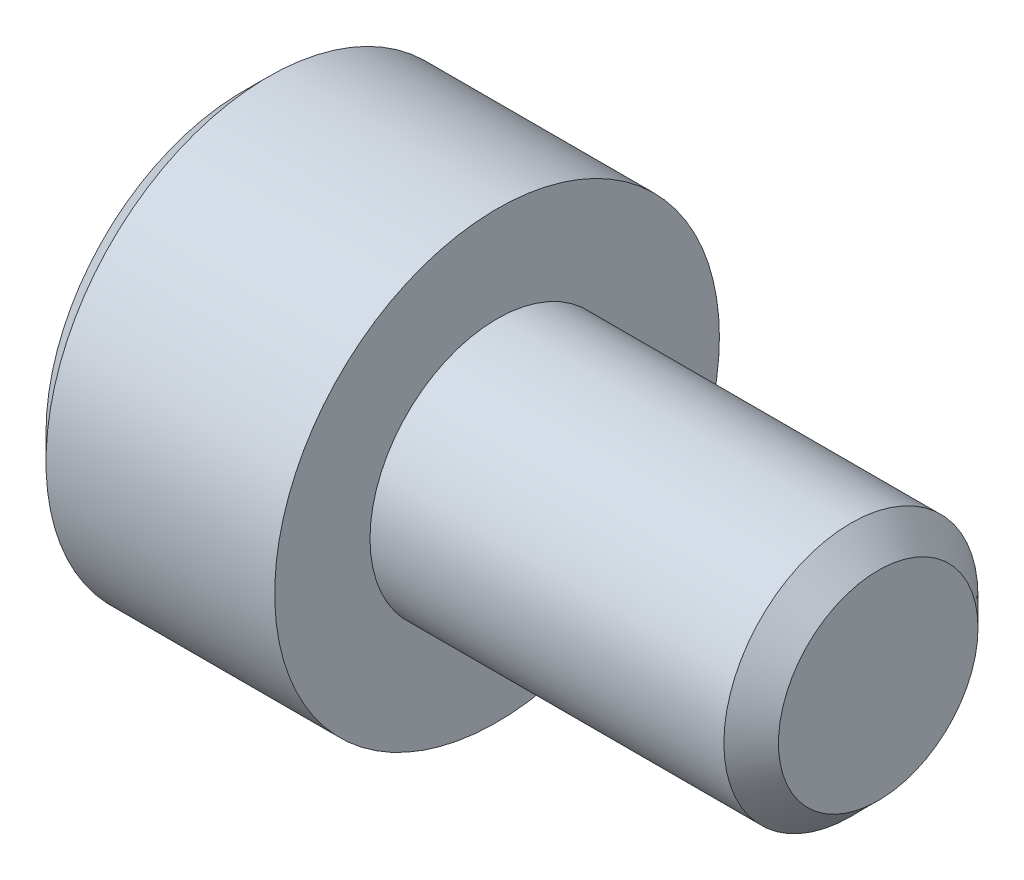
ISO-10303-21;
HEADER;
FILE_DESCRIPTION(('STEP AP214'),'2;1');
FILE_NAME('part.step','',(''),(''),'','','');
FILE_SCHEMA(('AUTOMOTIVE_DESIGN { 1 0 10303 214 1 1 1 1 }'));
ENDSEC;
DATA;
#1=APPLICATION_CONTEXT('core data for automotive mechanical design processes');
#2=APPLICATION_PROTOCOL_DEFINITION('international standard','automotive_design',2000,#1);
#3=PRODUCT_CONTEXT('',#1,'mechanical');
#4=PRODUCT('Part','Part','',(#3));
#5=PRODUCT_RELATED_PRODUCT_CATEGORY('part','',(#4));
#6=PRODUCT_DEFINITION_FORMATION('','',#4);
#7=PRODUCT_DEFINITION_CONTEXT('part definition',#1,'design');
#8=PRODUCT_DEFINITION('design','',#6,#7);
#9=PRODUCT_DEFINITION_SHAPE('','',#8);
#10=(LENGTH_UNIT() NAMED_UNIT(*) SI_UNIT(.MILLI.,.METRE.));
#11=(NAMED_UNIT(*) PLANE_ANGLE_UNIT() SI_UNIT($,.RADIAN.));
#12=(NAMED_UNIT(*) SI_UNIT($,.STERADIAN.) SOLID_ANGLE_UNIT());
#13=UNCERTAINTY_MEASURE_WITH_UNIT(LENGTH_MEASURE(1.E-05),#10,'distance_accuracy_value','');
#14=(GEOMETRIC_REPRESENTATION_CONTEXT(3) GLOBAL_UNCERTAINTY_ASSIGNED_CONTEXT((#13)) GLOBAL_UNIT_ASSIGNED_CONTEXT((#10,
#11,#12)) REPRESENTATION_CONTEXT('',''));
#15=CARTESIAN_POINT('',(0.,0.,0.));
#16=DIRECTION('',(0.,0.,1.));
#17=DIRECTION('',(1.,0.,0.));
#18=AXIS2_PLACEMENT_3D('',#15,#16,#17);
#19=CARTESIAN_POINT('',(-2.,0.,0.));
#20=DIRECTION('',(-1.,0.,0.));
#21=DIRECTION('',(0.,0.,1.));
#22=AXIS2_PLACEMENT_3D('',#19,#20,#21);
#23=CONICAL_SURFACE('',#22,1.5,1.30899693899575);
#24=CARTESIAN_POINT('',(-2.,0.,0.));
#25=DIRECTION('',(1.,0.,0.));
#26=DIRECTION('',(0.,0.,-1.));
#27=AXIS2_PLACEMENT_3D('',#24,#25,#26);
#28=CIRCLE('',#27,1.5);
#29=CARTESIAN_POINT('',(-2.,1.29903810567666,-0.75));
#30=VERTEX_POINT('',#29);
#31=CARTESIAN_POINT('',(-2.,1.29903810567666,0.75));
#32=VERTEX_POINT('',#31);
#33=EDGE_CURVE('E231',#30,#32,#28,.T.);
#34=ORIENTED_EDGE('',*,*,#33,.F.);
#35=CARTESIAN_POINT('',(-2.,0.,0.));
#36=DIRECTION('',(1.,0.,0.));
#37=DIRECTION('',(0.,0.,-1.));
#38=AXIS2_PLACEMENT_3D('',#35,#36,#37);
#39=CIRCLE('',#38,1.5);
#40=CARTESIAN_POINT('',(-2.,0.,-1.5));
#41=VERTEX_POINT('',#40);
#42=EDGE_CURVE('E228',#41,#30,#39,.T.);
#43=ORIENTED_EDGE('',*,*,#42,.F.);
#44=CARTESIAN_POINT('',(-2.,0.,0.));
#45=DIRECTION('',(1.,0.,0.));
#46=DIRECTION('',(0.,0.,-1.));
#47=AXIS2_PLACEMENT_3D('',#44,#45,#46);
#48=CIRCLE('',#47,1.5);
#49=CARTESIAN_POINT('',(-2.,-1.29903810567666,-0.75));
#50=VERTEX_POINT('',#49);
#51=EDGE_CURVE('E11',#50,#41,#48,.T.);
#52=ORIENTED_EDGE('',*,*,#51,.F.);
#53=CARTESIAN_POINT('',(-2.,0.,0.));
#54=DIRECTION('',(1.,0.,0.));
#55=DIRECTION('',(0.,0.,-1.));
#56=AXIS2_PLACEMENT_3D('',#53,#54,#55);
#57=CIRCLE('',#56,1.5);
#58=CARTESIAN_POINT('',(-2.,-1.29903810567666,0.75));
#59=VERTEX_POINT('',#58);
#60=EDGE_CURVE('E27',#59,#50,#57,.T.);
#61=ORIENTED_EDGE('',*,*,#60,.F.);
#62=CARTESIAN_POINT('',(-2.,0.,0.));
#63=DIRECTION('',(1.,0.,0.));
#64=DIRECTION('',(0.,0.,-1.));
#65=AXIS2_PLACEMENT_3D('',#62,#63,#64);
#66=CIRCLE('',#65,1.5);
#67=CARTESIAN_POINT('',(-2.,0.,1.5));
#68=VERTEX_POINT('',#67);
#69=EDGE_CURVE('E179',#68,#59,#66,.T.);
#70=ORIENTED_EDGE('',*,*,#69,.F.);
#71=CARTESIAN_POINT('',(-2.,0.,0.));
#72=DIRECTION('',(1.,0.,0.));
#73=DIRECTION('',(0.,0.,-1.));
#74=AXIS2_PLACEMENT_3D('',#71,#72,#73);
#75=CIRCLE('',#74,1.5);
#76=EDGE_CURVE('E39',#32,#68,#75,.T.);
#77=ORIENTED_EDGE('',*,*,#76,.F.);
#78=EDGE_LOOP('',(#34,#43,#52,#61,#70,#77));
#79=FACE_BOUND('',#78,.T.);
#80=CARTESIAN_POINT('',(-1.59807621135332,0.,0.));
#81=VERTEX_POINT('',#80);
#82=VERTEX_LOOP('',#81);
#83=FACE_BOUND('',#82,.T.);
#84=ADVANCED_FACE('F17',(#79,#83),#23,.F.);
#85=CARTESIAN_POINT('',(-2.,0.,0.));
#86=DIRECTION('',(1.,0.,0.));
#87=DIRECTION('',(0.,1.,0.));
#88=AXIS2_PLACEMENT_3D('',#85,#86,#87);
#89=PLANE('',#88);
#90=ORIENTED_EDGE('',*,*,#51,.T.);
#91=DIRECTION('',(0.,1.,0.));
#92=VECTOR('',#91,1.);
#93=CARTESIAN_POINT('',(-2.,-0.866025403784439,-1.5));
#94=LINE('',#93,#92);
#95=CARTESIAN_POINT('',(-2.,-0.866025403784439,-1.5));
#96=VERTEX_POINT('',#95);
#97=EDGE_CURVE('E185',#96,#41,#94,.T.);
#98=ORIENTED_EDGE('',*,*,#97,.F.);
#99=DIRECTION('',(0.,0.5,-0.866025403784439));
#100=VECTOR('',#99,1.);
#101=CARTESIAN_POINT('',(-2.,-1.73205080756888,0.));
#102=LINE('',#101,#100);
#103=EDGE_CURVE('E182',#50,#96,#102,.T.);
#104=ORIENTED_EDGE('',*,*,#103,.F.);
#105=EDGE_LOOP('',(#90,#98,#104));
#106=FACE_BOUND('',#105,.T.);
#107=ADVANCED_FACE('F19',(#106),#89,.F.);
#108=CARTESIAN_POINT('',(-2.,0.,0.));
#109=DIRECTION('',(1.,0.,0.));
#110=DIRECTION('',(0.,1.,0.));
#111=AXIS2_PLACEMENT_3D('',#108,#109,#110);
#112=PLANE('',#111);
#113=ORIENTED_EDGE('',*,*,#60,.T.);
#114=DIRECTION('',(0.,0.5,-0.866025403784439));
#115=VECTOR('',#114,1.);
#116=CARTESIAN_POINT('',(-2.,-1.73205080756888,0.));
#117=LINE('',#116,#115);
#118=CARTESIAN_POINT('',(-2.,-1.73205080756888,0.));
#119=VERTEX_POINT('',#118);
#120=EDGE_CURVE('E172',#119,#50,#117,.T.);
#121=ORIENTED_EDGE('',*,*,#120,.F.);
#122=DIRECTION('',(0.,-0.5,-0.866025403784439));
#123=VECTOR('',#122,1.);
#124=CARTESIAN_POINT('',(-2.,-0.866025403784439,1.5));
#125=LINE('',#124,#123);
#126=EDGE_CURVE('E175',#59,#119,#125,.T.);
#127=ORIENTED_EDGE('',*,*,#126,.F.);
#128=EDGE_LOOP('',(#113,#121,#127));
#129=FACE_BOUND('',#128,.T.);
#130=ADVANCED_FACE('F143',(#129),#112,.F.);
#131=CARTESIAN_POINT('',(-2.,0.,0.));
#132=DIRECTION('',(1.,0.,0.));
#133=DIRECTION('',(0.,1.,0.));
#134=AXIS2_PLACEMENT_3D('',#131,#132,#133);
#135=PLANE('',#134);
#136=ORIENTED_EDGE('',*,*,#69,.T.);
#137=DIRECTION('',(0.,-0.5,-0.866025403784439));
#138=VECTOR('',#137,1.);
#139=CARTESIAN_POINT('',(-2.,-0.866025403784439,1.5));
#140=LINE('',#139,#138);
#141=CARTESIAN_POINT('',(-2.,-0.866025403784439,1.5));
#142=VERTEX_POINT('',#141);
#143=EDGE_CURVE('E303',#142,#59,#140,.T.);
#144=ORIENTED_EDGE('',*,*,#143,.F.);
#145=DIRECTION('',(0.,-1.,0.));
#146=VECTOR('',#145,1.);
#147=CARTESIAN_POINT('',(-2.,0.866025403784439,1.5));
#148=LINE('',#147,#146);
#149=EDGE_CURVE('E289',#68,#142,#148,.T.);
#150=ORIENTED_EDGE('',*,*,#149,.F.);
#151=EDGE_LOOP('',(#136,#144,#150));
#152=FACE_BOUND('',#151,.T.);
#153=ADVANCED_FACE('F160',(#152),#135,.F.);
#154=CARTESIAN_POINT('',(-2.,0.,0.));
#155=DIRECTION('',(1.,0.,0.));
#156=DIRECTION('',(0.,1.,0.));
#157=AXIS2_PLACEMENT_3D('',#154,#155,#156);
#158=PLANE('',#157);
#159=ORIENTED_EDGE('',*,*,#76,.T.);
#160=DIRECTION('',(0.,-1.,0.));
#161=VECTOR('',#160,1.);
#162=CARTESIAN_POINT('',(-2.,0.866025403784439,1.5));
#163=LINE('',#162,#161);
#164=CARTESIAN_POINT('',(-2.,0.866025403784439,1.5));
#165=VERTEX_POINT('',#164);
#166=EDGE_CURVE('E284',#165,#68,#163,.T.);
#167=ORIENTED_EDGE('',*,*,#166,.F.);
#168=DIRECTION('',(0.,-0.5,0.866025403784439));
#169=VECTOR('',#168,1.);
#170=CARTESIAN_POINT('',(-2.,1.73205080756888,0.));
#171=LINE('',#170,#169);
#172=EDGE_CURVE('E225',#32,#165,#171,.T.);
#173=ORIENTED_EDGE('',*,*,#172,.F.);
#174=EDGE_LOOP('',(#159,#167,#173));
#175=FACE_BOUND('',#174,.T.);
#176=ADVANCED_FACE('F156',(#175),#158,.F.);
#177=CARTESIAN_POINT('',(-2.,0.,0.));
#178=DIRECTION('',(1.,0.,0.));
#179=DIRECTION('',(0.,1.,0.));
#180=AXIS2_PLACEMENT_3D('',#177,#178,#179);
#181=PLANE('',#180);
#182=DIRECTION('',(0.,0.5,0.866025403784439));
#183=VECTOR('',#182,1.);
#184=CARTESIAN_POINT('',(-2.,0.866025403784439,-1.5));
#185=LINE('',#184,#183);
#186=CARTESIAN_POINT('',(-2.,1.73205080756888,0.));
#187=VERTEX_POINT('',#186);
#188=EDGE_CURVE('E214',#30,#187,#185,.T.);
#189=ORIENTED_EDGE('',*,*,#188,.F.);
#190=ORIENTED_EDGE('',*,*,#33,.T.);
#191=DIRECTION('',(0.,-0.5,0.866025403784439));
#192=VECTOR('',#191,1.);
#193=CARTESIAN_POINT('',(-2.,1.73205080756888,0.));
#194=LINE('',#193,#192);
#195=EDGE_CURVE('E221',#187,#32,#194,.T.);
#196=ORIENTED_EDGE('',*,*,#195,.F.);
#197=EDGE_LOOP('',(#189,#190,#196));
#198=FACE_BOUND('',#197,.T.);
#199=ADVANCED_FACE('F152',(#198),#181,.F.);
#200=CARTESIAN_POINT('',(-2.,0.,0.));
#201=DIRECTION('',(1.,0.,0.));
#202=DIRECTION('',(0.,1.,0.));
#203=AXIS2_PLACEMENT_3D('',#200,#201,#202);
#204=PLANE('',#203);
#205=ORIENTED_EDGE('',*,*,#42,.T.);
#206=DIRECTION('',(0.,0.5,0.866025403784439));
#207=VECTOR('',#206,1.);
#208=CARTESIAN_POINT('',(-2.,0.866025403784439,-1.5));
#209=LINE('',#208,#207);
#210=CARTESIAN_POINT('',(-2.,0.866025403784438,-1.5));
#211=VERTEX_POINT('',#210);
#212=EDGE_CURVE('E213',#211,#30,#209,.T.);
#213=ORIENTED_EDGE('',*,*,#212,.F.);
#214=DIRECTION('',(0.,1.,0.));
#215=VECTOR('',#214,1.);
#216=CARTESIAN_POINT('',(-2.,-0.866025403784439,-1.5));
#217=LINE('',#216,#215);
#218=EDGE_CURVE('E206',#41,#211,#217,.T.);
#219=ORIENTED_EDGE('',*,*,#218,.F.);
#220=EDGE_LOOP('',(#205,#213,#219));
#221=FACE_BOUND('',#220,.T.);
#222=ADVANCED_FACE('F149',(#221),#204,.F.);
#223=CARTESIAN_POINT('',(-2.,1.73205080756888,0.));
#224=DIRECTION('',(0.,-0.866025403784439,-0.5));
#225=DIRECTION('',(0.,0.5,-0.866025403784439));
#226=AXIS2_PLACEMENT_3D('',#223,#224,#225);
#227=PLANE('',#226);
#228=DIRECTION('',(0.,-0.5,0.866025403784439));
#229=VECTOR('',#228,1.);
#230=CARTESIAN_POINT('',(-4.,1.73205080756888,0.));
#231=LINE('',#230,#229);
#232=CARTESIAN_POINT('',(-4.,1.73205080756888,0.));
#233=VERTEX_POINT('',#232);
#234=CARTESIAN_POINT('',(-4.,0.866025403784439,1.5));
#235=VERTEX_POINT('',#234);
#236=EDGE_CURVE('E256',#233,#235,#231,.T.);
#237=ORIENTED_EDGE('',*,*,#236,.F.);
#238=DIRECTION('',(-1.,0.,0.));
#239=VECTOR('',#238,1.);
#240=CARTESIAN_POINT('',(-2.,1.73205080756888,0.));
#241=LINE('',#240,#239);
#242=EDGE_CURVE('E218',#187,#233,#241,.T.);
#243=ORIENTED_EDGE('',*,*,#242,.F.);
#244=ORIENTED_EDGE('',*,*,#195,.T.);
#245=ORIENTED_EDGE('',*,*,#172,.T.);
#246=DIRECTION('',(-1.,0.,0.));
#247=VECTOR('',#246,1.);
#248=CARTESIAN_POINT('',(-2.,0.866025403784439,1.5));
#249=LINE('',#248,#247);
#250=EDGE_CURVE('E281',#165,#235,#249,.T.);
#251=ORIENTED_EDGE('',*,*,#250,.T.);
#252=EDGE_LOOP('',(#237,#243,#244,#245,#251));
#253=FACE_BOUND('',#252,.T.);
#254=ADVANCED_FACE('F147',(#253),#227,.T.);
#255=CARTESIAN_POINT('',(-2.,0.866025403784439,-1.5));
#256=DIRECTION('',(0.,-0.866025403784439,0.5));
#257=DIRECTION('',(-1.,0.,0.));
#258=AXIS2_PLACEMENT_3D('',#255,#256,#257);
#259=PLANE('',#258);
#260=DIRECTION('',(0.,0.5,0.866025403784439));
#261=VECTOR('',#260,1.);
#262=CARTESIAN_POINT('',(-4.,0.866025403784439,-1.5));
#263=LINE('',#262,#261);
#264=CARTESIAN_POINT('',(-4.,0.866025403784438,-1.5));
#265=VERTEX_POINT('',#264);
#266=EDGE_CURVE('E264',#265,#233,#263,.T.);
#267=ORIENTED_EDGE('',*,*,#266,.F.);
#268=DIRECTION('',(-1.,0.,0.));
#269=VECTOR('',#268,1.);
#270=CARTESIAN_POINT('',(-2.,0.866025403784438,-1.5));
#271=LINE('',#270,#269);
#272=EDGE_CURVE('E210',#211,#265,#271,.T.);
#273=ORIENTED_EDGE('',*,*,#272,.F.);
#274=ORIENTED_EDGE('',*,*,#212,.T.);
#275=ORIENTED_EDGE('',*,*,#188,.T.);
#276=ORIENTED_EDGE('',*,*,#242,.T.);
#277=EDGE_LOOP('',(#267,#273,#274,#275,#276));
#278=FACE_BOUND('',#277,.T.);
#279=ADVANCED_FACE('F323',(#278),#259,.T.);
#280=CARTESIAN_POINT('',(-2.,-0.866025403784439,-1.5));
#281=DIRECTION('',(0.,0.,1.));
#282=DIRECTION('',(1.,0.,0.));
#283=AXIS2_PLACEMENT_3D('',#280,#281,#282);
#284=PLANE('',#283);
#285=DIRECTION('',(0.,1.,0.));
#286=VECTOR('',#285,1.);
#287=CARTESIAN_POINT('',(-4.,-0.866025403784439,-1.5));
#288=LINE('',#287,#286);
#289=CARTESIAN_POINT('',(-4.,-0.866025403784439,-1.5));
#290=VERTEX_POINT('',#289);
#291=EDGE_CURVE('E260',#290,#265,#288,.T.);
#292=ORIENTED_EDGE('',*,*,#291,.F.);
#293=DIRECTION('',(-1.,0.,0.));
#294=VECTOR('',#293,1.);
#295=CARTESIAN_POINT('',(-2.,-0.866025403784439,-1.5));
#296=LINE('',#295,#294);
#297=EDGE_CURVE('E189',#96,#290,#296,.T.);
#298=ORIENTED_EDGE('',*,*,#297,.F.);
#299=ORIENTED_EDGE('',*,*,#97,.T.);
#300=ORIENTED_EDGE('',*,*,#218,.T.);
#301=ORIENTED_EDGE('',*,*,#272,.T.);
#302=EDGE_LOOP('',(#292,#298,#299,#300,#301));
#303=FACE_BOUND('',#302,.T.);
#304=ADVANCED_FACE('F327',(#303),#284,.T.);
#305=CARTESIAN_POINT('',(-2.,-1.73205080756888,0.));
#306=DIRECTION('',(0.,0.866025403784439,0.5));
#307=DIRECTION('',(1.,0.,0.));
#308=AXIS2_PLACEMENT_3D('',#305,#306,#307);
#309=PLANE('',#308);
#310=DIRECTION('',(0.,0.5,-0.866025403784439));
#311=VECTOR('',#310,1.);
#312=CARTESIAN_POINT('',(-4.,-1.73205080756888,0.));
#313=LINE('',#312,#311);
#314=CARTESIAN_POINT('',(-4.,-1.73205080756888,0.));
#315=VERTEX_POINT('',#314);
#316=EDGE_CURVE('E250',#315,#290,#313,.T.);
#317=ORIENTED_EDGE('',*,*,#316,.F.);
#318=DIRECTION('',(-1.,0.,0.));
#319=VECTOR('',#318,1.);
#320=CARTESIAN_POINT('',(-2.,-1.73205080756888,0.));
#321=LINE('',#320,#319);
#322=EDGE_CURVE('E193',#119,#315,#321,.T.);
#323=ORIENTED_EDGE('',*,*,#322,.F.);
#324=ORIENTED_EDGE('',*,*,#120,.T.);
#325=ORIENTED_EDGE('',*,*,#103,.T.);
#326=ORIENTED_EDGE('',*,*,#297,.T.);
#327=EDGE_LOOP('',(#317,#323,#324,#325,#326));
#328=FACE_BOUND('',#327,.T.);
#329=ADVANCED_FACE('F192',(#328),#309,.T.);
#330=CARTESIAN_POINT('',(-2.,-0.866025403784439,1.5));
#331=DIRECTION('',(0.,0.866025403784439,-0.5));
#332=DIRECTION('',(-1.,0.,0.));
#333=AXIS2_PLACEMENT_3D('',#330,#331,#332);
#334=PLANE('',#333);
#335=DIRECTION('',(0.,-0.5,-0.866025403784439));
#336=VECTOR('',#335,1.);
#337=CARTESIAN_POINT('',(-4.,-0.866025403784439,1.5));
#338=LINE('',#337,#336);
#339=CARTESIAN_POINT('',(-4.,-0.866025403784439,1.5));
#340=VERTEX_POINT('',#339);
#341=EDGE_CURVE('E255',#340,#315,#338,.T.);
#342=ORIENTED_EDGE('',*,*,#341,.F.);
#343=DIRECTION('',(-1.,0.,0.));
#344=VECTOR('',#343,1.);
#345=CARTESIAN_POINT('',(-2.,-0.866025403784439,1.5));
#346=LINE('',#345,#344);
#347=EDGE_CURVE('E247',#142,#340,#346,.T.);
#348=ORIENTED_EDGE('',*,*,#347,.F.);
#349=ORIENTED_EDGE('',*,*,#143,.T.);
#350=ORIENTED_EDGE('',*,*,#126,.T.);
#351=ORIENTED_EDGE('',*,*,#322,.T.);
#352=EDGE_LOOP('',(#342,#348,#349,#350,#351));
#353=FACE_BOUND('',#352,.T.);
#354=ADVANCED_FACE('F311',(#353),#334,.T.);
#355=CARTESIAN_POINT('',(-2.,0.866025403784439,1.5));
#356=DIRECTION('',(0.,0.,-1.));
#357=DIRECTION('',(0.,-1.,0.));
#358=AXIS2_PLACEMENT_3D('',#355,#356,#357);
#359=PLANE('',#358);
#360=DIRECTION('',(0.,-1.,0.));
#361=VECTOR('',#360,1.);
#362=CARTESIAN_POINT('',(-4.,0.866025403784439,1.5));
#363=LINE('',#362,#361);
#364=EDGE_CURVE('E251',#235,#340,#363,.T.);
#365=ORIENTED_EDGE('',*,*,#364,.F.);
#366=ORIENTED_EDGE('',*,*,#250,.F.);
#367=ORIENTED_EDGE('',*,*,#166,.T.);
#368=ORIENTED_EDGE('',*,*,#149,.T.);
#369=ORIENTED_EDGE('',*,*,#347,.T.);
#370=EDGE_LOOP('',(#365,#366,#367,#368,#369));
#371=FACE_BOUND('',#370,.T.);
#372=ADVANCED_FACE('F316',(#371),#359,.T.);
#373=CARTESIAN_POINT('',(6.,1.5705,0.));
#374=DIRECTION('',(-1.,0.,0.));
#375=DIRECTION('',(0.,0.,1.));
#376=AXIS2_PLACEMENT_3D('',#373,#374,#375);
#377=PLANE('',#376);
#378=CARTESIAN_POINT('',(6.,0.,0.));
#379=DIRECTION('',(1.,0.,0.));
#380=DIRECTION('',(0.,0.,-1.));
#381=AXIS2_PLACEMENT_3D('',#378,#379,#380);
#382=CIRCLE('',#381,1.5705);
#383=CARTESIAN_POINT('',(6.,0.,-1.5705));
#384=VERTEX_POINT('',#383);
#385=EDGE_CURVE('E285',#384,#384,#382,.T.);
#386=ORIENTED_EDGE('',*,*,#385,.T.);
#387=EDGE_LOOP('',(#386));
#388=FACE_BOUND('',#387,.T.);
#389=ADVANCED_FACE('F523',(#388),#377,.F.);
#390=CARTESIAN_POINT('',(5.5705,0.,0.));
#391=DIRECTION('',(-1.,0.,0.));
#392=DIRECTION('',(0.,0.,1.));
#393=AXIS2_PLACEMENT_3D('',#390,#391,#392);
#394=CONICAL_SURFACE('',#393,2.,0.785398163397448);
#395=CARTESIAN_POINT('',(5.5705,0.,0.));
#396=DIRECTION('',(1.,0.,0.));
#397=DIRECTION('',(0.,0.,-1.));
#398=AXIS2_PLACEMENT_3D('',#395,#396,#397);
#399=CIRCLE('',#398,2.);
#400=CARTESIAN_POINT('',(5.5705,0.,-2.));
#401=VERTEX_POINT('',#400);
#402=EDGE_CURVE('E288',#401,#401,#399,.T.);
#403=ORIENTED_EDGE('',*,*,#402,.T.);
#404=EDGE_LOOP('',(#403));
#405=FACE_BOUND('',#404,.T.);
#406=ORIENTED_EDGE('',*,*,#385,.F.);
#407=EDGE_LOOP('',(#406));
#408=FACE_BOUND('',#407,.T.);
#409=ADVANCED_FACE('F503',(#405,#408),#394,.T.);
#410=CARTESIAN_POINT('',(6.,0.,0.));
#411=DIRECTION('',(1.,0.,0.));
#412=DIRECTION('',(0.,0.,-1.));
#413=AXIS2_PLACEMENT_3D('',#410,#411,#412);
#414=CYLINDRICAL_SURFACE('',#413,2.);
#415=CARTESIAN_POINT('',(0.,0.,0.));
#416=DIRECTION('',(1.,0.,0.));
#417=DIRECTION('',(0.,0.,-1.));
#418=AXIS2_PLACEMENT_3D('',#415,#416,#417);
#419=CIRCLE('',#418,2.);
#420=CARTESIAN_POINT('',(0.,0.,-2.));
#421=VERTEX_POINT('',#420);
#422=EDGE_CURVE('E268',#421,#421,#419,.T.);
#423=ORIENTED_EDGE('',*,*,#422,.T.);
#424=EDGE_LOOP('',(#423));
#425=FACE_BOUND('',#424,.T.);
#426=ORIENTED_EDGE('',*,*,#402,.F.);
#427=EDGE_LOOP('',(#426));
#428=FACE_BOUND('',#427,.T.);
#429=ADVANCED_FACE('F474',(#425,#428),#414,.T.);
#430=CARTESIAN_POINT('',(0.,3.5,0.));
#431=DIRECTION('',(-1.,0.,0.));
#432=DIRECTION('',(0.,0.,1.));
#433=AXIS2_PLACEMENT_3D('',#430,#431,#432);
#434=PLANE('',#433);
#435=CARTESIAN_POINT('',(0.,0.,0.));
#436=DIRECTION('',(1.,0.,0.));
#437=DIRECTION('',(0.,0.,-1.));
#438=AXIS2_PLACEMENT_3D('',#435,#436,#437);
#439=CIRCLE('',#438,3.5);
#440=CARTESIAN_POINT('',(0.,0.,-3.5));
#441=VERTEX_POINT('',#440);
#442=EDGE_CURVE('E265',#441,#441,#439,.T.);
#443=ORIENTED_EDGE('',*,*,#442,.T.);
#444=EDGE_LOOP('',(#443));
#445=FACE_BOUND('',#444,.T.);
#446=ORIENTED_EDGE('',*,*,#422,.F.);
#447=EDGE_LOOP('',(#446));
#448=FACE_BOUND('',#447,.T.);
#449=ADVANCED_FACE('F452',(#445,#448),#434,.F.);
#450=CARTESIAN_POINT('',(6.,0.,0.));
#451=DIRECTION('',(1.,0.,0.));
#452=DIRECTION('',(0.,0.,-1.));
#453=AXIS2_PLACEMENT_3D('',#450,#451,#452);
#454=CYLINDRICAL_SURFACE('',#453,3.5);
#455=CARTESIAN_POINT('',(-3.6,0.,0.));
#456=DIRECTION('',(1.,0.,0.));
#457=DIRECTION('',(0.,0.,-1.));
#458=AXIS2_PLACEMENT_3D('',#455,#456,#457);
#459=CIRCLE('',#458,3.5);
#460=CARTESIAN_POINT('',(-3.6,0.,-3.5));
#461=VERTEX_POINT('',#460);
#462=EDGE_CURVE('E269',#461,#461,#459,.T.);
#463=ORIENTED_EDGE('',*,*,#462,.T.);
#464=EDGE_LOOP('',(#463));
#465=FACE_BOUND('',#464,.T.);
#466=ORIENTED_EDGE('',*,*,#442,.F.);
#467=EDGE_LOOP('',(#466));
#468=FACE_BOUND('',#467,.T.);
#469=ADVANCED_FACE('F442',(#465,#468),#454,.T.);
#470=CARTESIAN_POINT('',(-4.,0.,0.));
#471=DIRECTION('',(1.,0.,0.));
#472=DIRECTION('',(0.,0.,-1.));
#473=AXIS2_PLACEMENT_3D('',#470,#471,#472);
#474=CONICAL_SURFACE('',#473,3.1,0.785398163397449);
#475=CARTESIAN_POINT('',(-4.,0.,0.));
#476=DIRECTION('',(1.,0.,0.));
#477=DIRECTION('',(0.,0.,-1.));
#478=AXIS2_PLACEMENT_3D('',#475,#476,#477);
#479=CIRCLE('',#478,3.1);
#480=CARTESIAN_POINT('',(-4.,0.,-3.1));
#481=VERTEX_POINT('',#480);
#482=EDGE_CURVE('E132',#481,#481,#479,.T.);
#483=ORIENTED_EDGE('',*,*,#482,.T.);
#484=EDGE_LOOP('',(#483));
#485=FACE_BOUND('',#484,.T.);
#486=ORIENTED_EDGE('',*,*,#462,.F.);
#487=EDGE_LOOP('',(#486));
#488=FACE_BOUND('',#487,.T.);
#489=ADVANCED_FACE('F431',(#485,#488),#474,.T.);
#490=CARTESIAN_POINT('',(-4.,0.,0.));
#491=DIRECTION('',(1.,0.,0.));
#492=DIRECTION('',(0.,1.,0.));
#493=AXIS2_PLACEMENT_3D('',#490,#491,#492);
#494=PLANE('',#493);
#495=ORIENTED_EDGE('',*,*,#316,.T.);
#496=ORIENTED_EDGE('',*,*,#291,.T.);
#497=ORIENTED_EDGE('',*,*,#266,.T.);
#498=ORIENTED_EDGE('',*,*,#236,.T.);
#499=ORIENTED_EDGE('',*,*,#364,.T.);
#500=ORIENTED_EDGE('',*,*,#341,.T.);
#501=EDGE_LOOP('',(#495,#496,#497,#498,#499,#500));
#502=FACE_BOUND('',#501,.T.);
#503=ORIENTED_EDGE('',*,*,#482,.F.);
#504=EDGE_LOOP('',(#503));
#505=FACE_BOUND('',#504,.T.);
#506=ADVANCED_FACE('F329',(#502,#505),#494,.F.);
#507=CLOSED_SHELL('',(#84,#107,#130,#153,#176,#199,#222,#254,#279,#304,#329,#354,#372,#389,#409,
#429,#449,#469,#489,#506));
#508=MANIFOLD_SOLID_BREP('B1',#507);
#509=ADVANCED_BREP_SHAPE_REPRESENTATION('',(#18,#508),#14);
#510=SHAPE_DEFINITION_REPRESENTATION(#9,#509);
ENDSEC;
END-ISO-10303-21;
